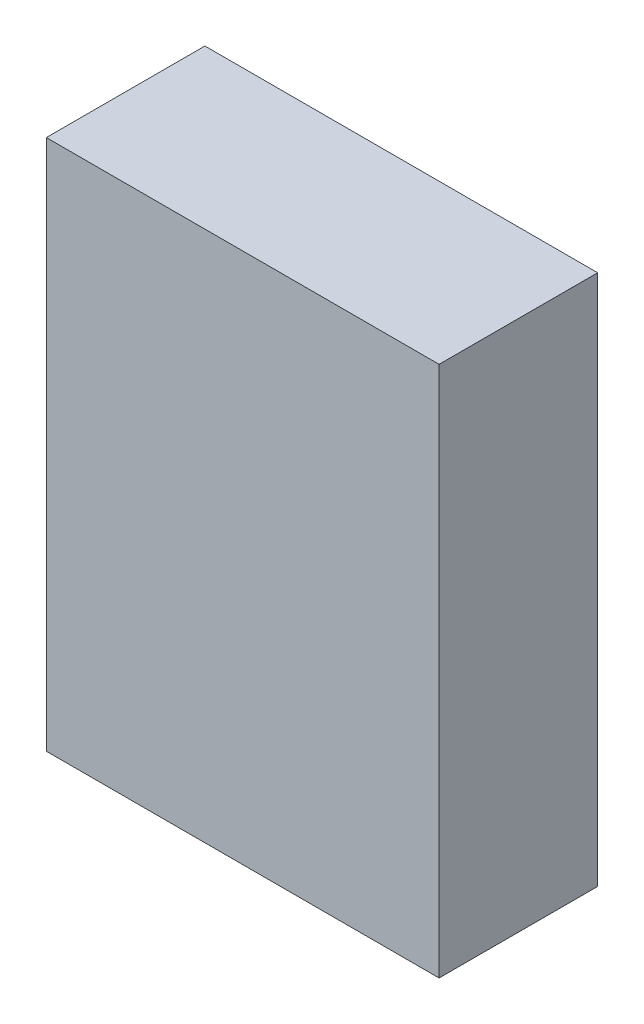
ISO-10303-21;
HEADER;
FILE_DESCRIPTION(('STEP AP214'),'2;1');
FILE_NAME('part.step','',(''),(''),'','','');
FILE_SCHEMA(('AUTOMOTIVE_DESIGN { 1 0 10303 214 1 1 1 1 }'));
ENDSEC;
DATA;
#1=APPLICATION_CONTEXT('core data for automotive mechanical design processes');
#2=APPLICATION_PROTOCOL_DEFINITION('international standard','automotive_design',2000,#1);
#3=PRODUCT_CONTEXT('',#1,'mechanical');
#4=PRODUCT('Part','Part','',(#3));
#5=PRODUCT_RELATED_PRODUCT_CATEGORY('part','',(#4));
#6=PRODUCT_DEFINITION_FORMATION('','',#4);
#7=PRODUCT_DEFINITION_CONTEXT('part definition',#1,'design');
#8=PRODUCT_DEFINITION('design','',#6,#7);
#9=PRODUCT_DEFINITION_SHAPE('','',#8);
#10=(LENGTH_UNIT() NAMED_UNIT(*) SI_UNIT(.MILLI.,.METRE.));
#11=(NAMED_UNIT(*) PLANE_ANGLE_UNIT() SI_UNIT($,.RADIAN.));
#12=(NAMED_UNIT(*) SI_UNIT($,.STERADIAN.) SOLID_ANGLE_UNIT());
#13=UNCERTAINTY_MEASURE_WITH_UNIT(LENGTH_MEASURE(1.E-05),#10,'distance_accuracy_value','');
#14=(GEOMETRIC_REPRESENTATION_CONTEXT(3) GLOBAL_UNCERTAINTY_ASSIGNED_CONTEXT((#13)) GLOBAL_UNIT_ASSIGNED_CONTEXT((#10,
#11,#12)) REPRESENTATION_CONTEXT('',''));
#15=CARTESIAN_POINT('',(0.,0.,0.));
#16=DIRECTION('',(0.,0.,1.));
#17=DIRECTION('',(1.,0.,0.));
#18=AXIS2_PLACEMENT_3D('',#15,#16,#17);
#19=CARTESIAN_POINT('',(33.8319366857526,-43.18,135.692840532338));
#20=DIRECTION('',(0.,1.,0.));
#21=DIRECTION('',(-1.,0.,0.));
#22=AXIS2_PLACEMENT_3D('',#19,#20,#21);
#23=PLANE('',#22);
#24=DIRECTION('',(1.,0.,0.));
#25=VECTOR('',#24,1.);
#26=CARTESIAN_POINT('',(33.8319366857526,-43.18,25.769000024));
#27=LINE('',#26,#25);
#28=CARTESIAN_POINT('',(-29.99,-43.18,25.769000024));
#29=VERTEX_POINT('',#28);
#30=CARTESIAN_POINT('',(33.8319366857526,-43.18,25.769000024));
#31=VERTEX_POINT('',#30);
#32=EDGE_CURVE('E82',#29,#31,#27,.T.);
#33=ORIENTED_EDGE('',*,*,#32,.F.);
#34=DIRECTION('',(0.,0.,-1.));
#35=VECTOR('',#34,1.);
#36=CARTESIAN_POINT('',(-29.99,-43.18,135.692840532338));
#37=LINE('',#36,#35);
#38=CARTESIAN_POINT('',(-29.99,-43.18,0.));
#39=VERTEX_POINT('',#38);
#40=EDGE_CURVE('E50',#29,#39,#37,.T.);
#41=ORIENTED_EDGE('',*,*,#40,.T.);
#42=DIRECTION('',(1.,0.,0.));
#43=VECTOR('',#42,1.);
#44=CARTESIAN_POINT('',(33.8319366857526,-43.18,0.));
#45=LINE('',#44,#43);
#46=CARTESIAN_POINT('',(33.8319366857526,-43.18,0.));
#47=VERTEX_POINT('',#46);
#48=EDGE_CURVE('E86',#39,#47,#45,.T.);
#49=ORIENTED_EDGE('',*,*,#48,.T.);
#50=DIRECTION('',(0.,0.,-1.));
#51=VECTOR('',#50,1.);
#52=CARTESIAN_POINT('',(33.8319366857526,-43.18,135.692840532338));
#53=LINE('',#52,#51);
#54=EDGE_CURVE('E78',#31,#47,#53,.T.);
#55=ORIENTED_EDGE('',*,*,#54,.F.);
#56=EDGE_LOOP('',(#33,#41,#49,#55));
#57=FACE_BOUND('',#56,.T.);
#58=ADVANCED_FACE('F33',(#57),#23,.F.);
#59=CARTESIAN_POINT('',(33.8319366857526,43.18,135.692840532338));
#60=DIRECTION('',(-1.,0.,0.));
#61=DIRECTION('',(0.,0.,1.));
#62=AXIS2_PLACEMENT_3D('',#59,#60,#61);
#63=PLANE('',#62);
#64=DIRECTION('',(0.,1.,0.));
#65=VECTOR('',#64,1.);
#66=CARTESIAN_POINT('',(33.8319366857526,43.18,25.769000024));
#67=LINE('',#66,#65);
#68=CARTESIAN_POINT('',(33.8319366857526,43.18,25.769000024));
#69=VERTEX_POINT('',#68);
#70=EDGE_CURVE('E42',#31,#69,#67,.T.);
#71=ORIENTED_EDGE('',*,*,#70,.F.);
#72=ORIENTED_EDGE('',*,*,#54,.T.);
#73=DIRECTION('',(0.,1.,0.));
#74=VECTOR('',#73,1.);
#75=CARTESIAN_POINT('',(33.8319366857526,43.18,0.));
#76=LINE('',#75,#74);
#77=CARTESIAN_POINT('',(33.8319366857526,43.18,0.));
#78=VERTEX_POINT('',#77);
#79=EDGE_CURVE('E88',#47,#78,#76,.T.);
#80=ORIENTED_EDGE('',*,*,#79,.T.);
#81=DIRECTION('',(0.,0.,-1.));
#82=VECTOR('',#81,1.);
#83=CARTESIAN_POINT('',(33.8319366857526,43.18,135.692840532338));
#84=LINE('',#83,#82);
#85=EDGE_CURVE('E79',#69,#78,#84,.T.);
#86=ORIENTED_EDGE('',*,*,#85,.F.);
#87=EDGE_LOOP('',(#71,#72,#80,#86));
#88=FACE_BOUND('',#87,.T.);
#89=ADVANCED_FACE('F76',(#88),#63,.F.);
#90=CARTESIAN_POINT('',(33.8319366857526,43.18,135.692840532338));
#91=DIRECTION('',(0.,-1.,0.));
#92=DIRECTION('',(1.,0.,0.));
#93=AXIS2_PLACEMENT_3D('',#90,#91,#92);
#94=PLANE('',#93);
#95=DIRECTION('',(-1.,0.,0.));
#96=VECTOR('',#95,1.);
#97=CARTESIAN_POINT('',(33.8319366857526,43.18,25.769000024));
#98=LINE('',#97,#96);
#99=CARTESIAN_POINT('',(-29.99,43.18,25.769000024));
#100=VERTEX_POINT('',#99);
#101=EDGE_CURVE('E11',#69,#100,#98,.T.);
#102=ORIENTED_EDGE('',*,*,#101,.F.);
#103=ORIENTED_EDGE('',*,*,#85,.T.);
#104=DIRECTION('',(-1.,0.,0.));
#105=VECTOR('',#104,1.);
#106=CARTESIAN_POINT('',(33.8319366857526,43.18,0.));
#107=LINE('',#106,#105);
#108=CARTESIAN_POINT('',(-29.99,43.18,0.));
#109=VERTEX_POINT('',#108);
#110=EDGE_CURVE('E95',#78,#109,#107,.T.);
#111=ORIENTED_EDGE('',*,*,#110,.T.);
#112=DIRECTION('',(0.,0.,-1.));
#113=VECTOR('',#112,1.);
#114=CARTESIAN_POINT('',(-29.99,43.18,135.692840532338));
#115=LINE('',#114,#113);
#116=EDGE_CURVE('E37',#100,#109,#115,.T.);
#117=ORIENTED_EDGE('',*,*,#116,.F.);
#118=EDGE_LOOP('',(#102,#103,#111,#117));
#119=FACE_BOUND('',#118,.T.);
#120=ADVANCED_FACE('F107',(#119),#94,.F.);
#121=CARTESIAN_POINT('',(-29.99,0.,135.692840532338));
#122=DIRECTION('',(1.,0.,0.));
#123=DIRECTION('',(0.,1.,0.));
#124=AXIS2_PLACEMENT_3D('',#121,#122,#123);
#125=PLANE('',#124);
#126=DIRECTION('',(0.,-1.,0.));
#127=VECTOR('',#126,1.);
#128=CARTESIAN_POINT('',(-29.99,0.,25.769000024));
#129=LINE('',#128,#127);
#130=EDGE_CURVE('E90',#100,#29,#129,.T.);
#131=ORIENTED_EDGE('',*,*,#130,.F.);
#132=ORIENTED_EDGE('',*,*,#116,.T.);
#133=DIRECTION('',(0.,-1.,0.));
#134=VECTOR('',#133,1.);
#135=CARTESIAN_POINT('',(-29.99,0.,0.));
#136=LINE('',#135,#134);
#137=EDGE_CURVE('E92',#109,#39,#136,.T.);
#138=ORIENTED_EDGE('',*,*,#137,.T.);
#139=ORIENTED_EDGE('',*,*,#40,.F.);
#140=EDGE_LOOP('',(#131,#132,#138,#139));
#141=FACE_BOUND('',#140,.T.);
#142=ADVANCED_FACE('F104',(#141),#125,.F.);
#143=CARTESIAN_POINT('',(0.,0.,0.));
#144=DIRECTION('',(0.,0.,-1.));
#145=DIRECTION('',(-1.,0.,0.));
#146=AXIS2_PLACEMENT_3D('',#143,#144,#145);
#147=PLANE('',#146);
#148=ORIENTED_EDGE('',*,*,#48,.F.);
#149=ORIENTED_EDGE('',*,*,#137,.F.);
#150=ORIENTED_EDGE('',*,*,#110,.F.);
#151=ORIENTED_EDGE('',*,*,#79,.F.);
#152=EDGE_LOOP('',(#148,#149,#150,#151));
#153=FACE_BOUND('',#152,.T.);
#154=ADVANCED_FACE('F106',(#153),#147,.T.);
#155=CARTESIAN_POINT('',(255.27,0.,25.769000024));
#156=DIRECTION('',(0.,0.,1.));
#157=DIRECTION('',(1.,0.,0.));
#158=AXIS2_PLACEMENT_3D('',#155,#156,#157);
#159=PLANE('',#158);
#160=ORIENTED_EDGE('',*,*,#130,.T.);
#161=ORIENTED_EDGE('',*,*,#32,.T.);
#162=ORIENTED_EDGE('',*,*,#70,.T.);
#163=ORIENTED_EDGE('',*,*,#101,.T.);
#164=EDGE_LOOP('',(#160,#161,#162,#163));
#165=FACE_BOUND('',#164,.T.);
#166=ADVANCED_FACE('F35',(#165),#159,.T.);
#167=CLOSED_SHELL('',(#58,#89,#120,#142,#154,#166));
#168=MANIFOLD_SOLID_BREP('B2',#167);
#169=ADVANCED_BREP_SHAPE_REPRESENTATION('',(#18,#168),#14);
#170=SHAPE_DEFINITION_REPRESENTATION(#9,#169);
ENDSEC;
END-ISO-10303-21;
